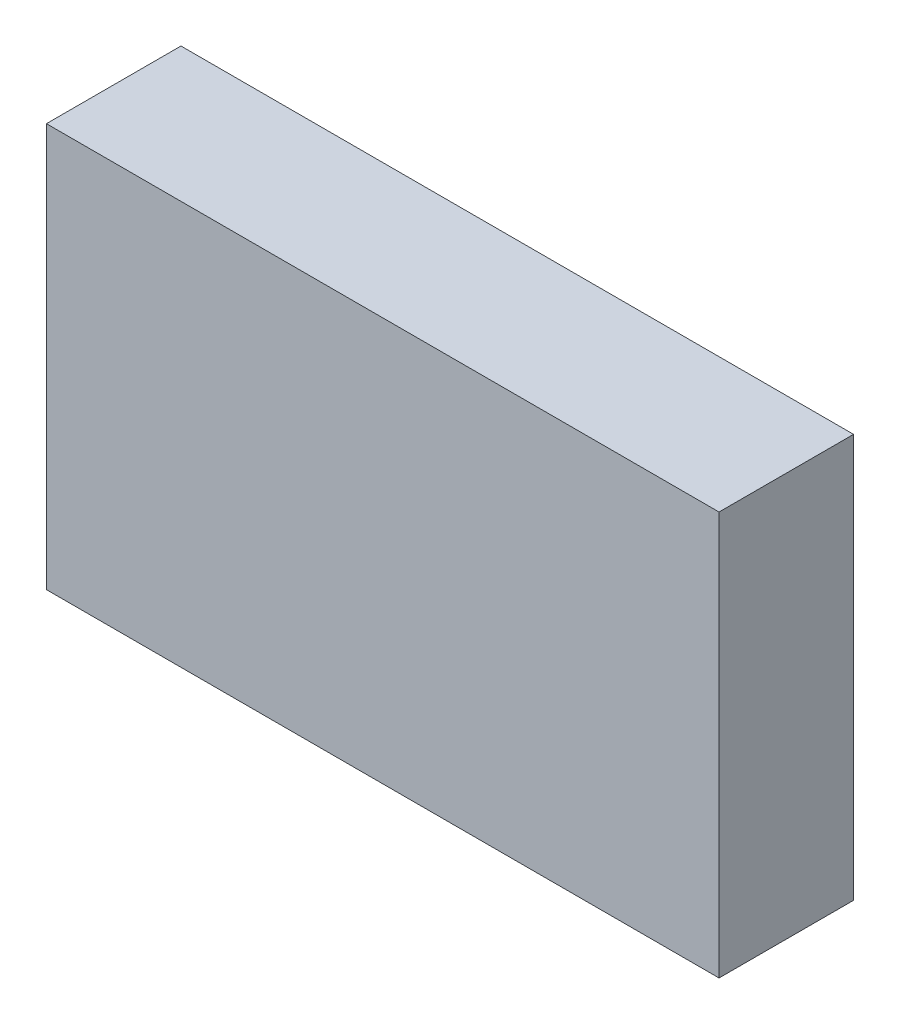
ISO-10303-21;
HEADER;
FILE_DESCRIPTION(('STEP AP214'),'2;1');
FILE_NAME('part.step','',(''),(''),'','','');
FILE_SCHEMA(('AUTOMOTIVE_DESIGN { 1 0 10303 214 1 1 1 1 }'));
ENDSEC;
DATA;
#1=APPLICATION_CONTEXT('core data for automotive mechanical design processes');
#2=APPLICATION_PROTOCOL_DEFINITION('international standard','automotive_design',2000,#1);
#3=PRODUCT_CONTEXT('',#1,'mechanical');
#4=PRODUCT('Part','Part','',(#3));
#5=PRODUCT_RELATED_PRODUCT_CATEGORY('part','',(#4));
#6=PRODUCT_DEFINITION_FORMATION('','',#4);
#7=PRODUCT_DEFINITION_CONTEXT('part definition',#1,'design');
#8=PRODUCT_DEFINITION('design','',#6,#7);
#9=PRODUCT_DEFINITION_SHAPE('','',#8);
#10=(LENGTH_UNIT() NAMED_UNIT(*) SI_UNIT(.MILLI.,.METRE.));
#11=(NAMED_UNIT(*) PLANE_ANGLE_UNIT() SI_UNIT($,.RADIAN.));
#12=(NAMED_UNIT(*) SI_UNIT($,.STERADIAN.) SOLID_ANGLE_UNIT());
#13=UNCERTAINTY_MEASURE_WITH_UNIT(LENGTH_MEASURE(1.E-05),#10,'distance_accuracy_value','');
#14=(GEOMETRIC_REPRESENTATION_CONTEXT(3) GLOBAL_UNCERTAINTY_ASSIGNED_CONTEXT((#13)) GLOBAL_UNIT_ASSIGNED_CONTEXT((#10,
#11,#12)) REPRESENTATION_CONTEXT('',''));
#15=CARTESIAN_POINT('',(0.,0.,0.));
#16=DIRECTION('',(0.,0.,1.));
#17=DIRECTION('',(1.,0.,0.));
#18=AXIS2_PLACEMENT_3D('',#15,#16,#17);
#19=CARTESIAN_POINT('',(-5.00000007450469,6.5689994413454,-2.12));
#20=DIRECTION('',(-1.,0.,0.));
#21=DIRECTION('',(0.,0.,1.));
#22=AXIS2_PLACEMENT_3D('',#19,#20,#21);
#23=PLANE('',#22);
#24=DIRECTION('',(0.,-1.,0.));
#25=VECTOR('',#24,1.);
#26=CARTESIAN_POINT('',(-5.00000007450469,9.5689994413454,-2.12));
#27=LINE('',#26,#25);
#28=CARTESIAN_POINT('',(-5.00000007450469,9.5689994413454,-2.12));
#29=VERTEX_POINT('',#28);
#30=CARTESIAN_POINT('',(-5.00000007450469,6.5689994413454,-2.12));
#31=VERTEX_POINT('',#30);
#32=EDGE_CURVE('E78',#29,#31,#27,.T.);
#33=ORIENTED_EDGE('',*,*,#32,.F.);
#34=DIRECTION('',(0.,0.,-1.));
#35=VECTOR('',#34,1.);
#36=CARTESIAN_POINT('',(-5.00000007450469,9.5689994413454,-2.12));
#37=LINE('',#36,#35);
#38=CARTESIAN_POINT('',(-5.00000007450469,9.5689994413454,-3.12));
#39=VERTEX_POINT('',#38);
#40=EDGE_CURVE('E66',#29,#39,#37,.T.);
#41=ORIENTED_EDGE('',*,*,#40,.T.);
#42=DIRECTION('',(0.,1.,0.));
#43=VECTOR('',#42,1.);
#44=CARTESIAN_POINT('',(-5.00000007450469,9.5689994413454,-3.12));
#45=LINE('',#44,#43);
#46=CARTESIAN_POINT('',(-5.00000007450469,6.5689994413454,-3.12));
#47=VERTEX_POINT('',#46);
#48=EDGE_CURVE('E97',#47,#39,#45,.T.);
#49=ORIENTED_EDGE('',*,*,#48,.F.);
#50=DIRECTION('',(0.,0.,-1.));
#51=VECTOR('',#50,1.);
#52=CARTESIAN_POINT('',(-5.00000007450469,6.5689994413454,-2.12));
#53=LINE('',#52,#51);
#54=EDGE_CURVE('E11',#31,#47,#53,.T.);
#55=ORIENTED_EDGE('',*,*,#54,.F.);
#56=EDGE_LOOP('',(#33,#41,#49,#55));
#57=FACE_BOUND('',#56,.T.);
#58=ADVANCED_FACE('F16',(#57),#23,.T.);
#59=CARTESIAN_POINT('',(-7.45046914787939E-08,6.5689994413454,-2.12));
#60=DIRECTION('',(0.,-1.,0.));
#61=DIRECTION('',(0.,0.,-1.));
#62=AXIS2_PLACEMENT_3D('',#59,#60,#61);
#63=PLANE('',#62);
#64=DIRECTION('',(1.,0.,0.));
#65=VECTOR('',#64,1.);
#66=CARTESIAN_POINT('',(-5.00000007450469,6.5689994413454,-2.12));
#67=LINE('',#66,#65);
#68=CARTESIAN_POINT('',(-7.45046914787939E-08,6.5689994413454,-2.12));
#69=VERTEX_POINT('',#68);
#70=EDGE_CURVE('E82',#31,#69,#67,.T.);
#71=ORIENTED_EDGE('',*,*,#70,.F.);
#72=ORIENTED_EDGE('',*,*,#54,.T.);
#73=DIRECTION('',(-1.,0.,0.));
#74=VECTOR('',#73,1.);
#75=CARTESIAN_POINT('',(-5.00000007450469,6.5689994413454,-3.12));
#76=LINE('',#75,#74);
#77=CARTESIAN_POINT('',(-7.45046914787939E-08,6.5689994413454,-3.12));
#78=VERTEX_POINT('',#77);
#79=EDGE_CURVE('E105',#78,#47,#76,.T.);
#80=ORIENTED_EDGE('',*,*,#79,.F.);
#81=DIRECTION('',(0.,0.,-1.));
#82=VECTOR('',#81,1.);
#83=CARTESIAN_POINT('',(-7.45046914787939E-08,6.5689994413454,-2.12));
#84=LINE('',#83,#82);
#85=EDGE_CURVE('E27',#69,#78,#84,.T.);
#86=ORIENTED_EDGE('',*,*,#85,.F.);
#87=EDGE_LOOP('',(#71,#72,#80,#86));
#88=FACE_BOUND('',#87,.T.);
#89=ADVANCED_FACE('F132',(#88),#63,.T.);
#90=CARTESIAN_POINT('',(-7.45046914787939E-08,9.5689994413454,-2.12));
#91=DIRECTION('',(1.,0.,0.));
#92=DIRECTION('',(0.,1.,0.));
#93=AXIS2_PLACEMENT_3D('',#90,#91,#92);
#94=PLANE('',#93);
#95=DIRECTION('',(0.,1.,0.));
#96=VECTOR('',#95,1.);
#97=CARTESIAN_POINT('',(-7.45046914787939E-08,6.5689994413454,-2.12));
#98=LINE('',#97,#96);
#99=CARTESIAN_POINT('',(-7.45046914787939E-08,9.5689994413454,-2.12));
#100=VERTEX_POINT('',#99);
#101=EDGE_CURVE('E87',#69,#100,#98,.T.);
#102=ORIENTED_EDGE('',*,*,#101,.F.);
#103=ORIENTED_EDGE('',*,*,#85,.T.);
#104=DIRECTION('',(0.,-1.,0.));
#105=VECTOR('',#104,1.);
#106=CARTESIAN_POINT('',(-7.45046914787939E-08,6.5689994413454,-3.12));
#107=LINE('',#106,#105);
#108=CARTESIAN_POINT('',(-7.45046914787939E-08,9.5689994413454,-3.12));
#109=VERTEX_POINT('',#108);
#110=EDGE_CURVE('E20',#109,#78,#107,.T.);
#111=ORIENTED_EDGE('',*,*,#110,.F.);
#112=DIRECTION('',(0.,0.,-1.));
#113=VECTOR('',#112,1.);
#114=CARTESIAN_POINT('',(-7.45046914787939E-08,9.5689994413454,-2.12));
#115=LINE('',#114,#113);
#116=EDGE_CURVE('E75',#100,#109,#115,.T.);
#117=ORIENTED_EDGE('',*,*,#116,.F.);
#118=EDGE_LOOP('',(#102,#103,#111,#117));
#119=FACE_BOUND('',#118,.T.);
#120=ADVANCED_FACE('F128',(#119),#94,.T.);
#121=CARTESIAN_POINT('',(-5.00000007450469,9.5689994413454,-2.12));
#122=DIRECTION('',(0.,1.,0.));
#123=DIRECTION('',(1.,0.,0.));
#124=AXIS2_PLACEMENT_3D('',#121,#122,#123);
#125=PLANE('',#124);
#126=DIRECTION('',(-1.,0.,0.));
#127=VECTOR('',#126,1.);
#128=CARTESIAN_POINT('',(-7.45046914787939E-08,9.5689994413454,-2.12));
#129=LINE('',#128,#127);
#130=EDGE_CURVE('E69',#100,#29,#129,.T.);
#131=ORIENTED_EDGE('',*,*,#130,.F.);
#132=ORIENTED_EDGE('',*,*,#116,.T.);
#133=DIRECTION('',(1.,0.,0.));
#134=VECTOR('',#133,1.);
#135=CARTESIAN_POINT('',(-7.45046914787939E-08,9.5689994413454,-3.12));
#136=LINE('',#135,#134);
#137=EDGE_CURVE('E71',#39,#109,#136,.T.);
#138=ORIENTED_EDGE('',*,*,#137,.F.);
#139=ORIENTED_EDGE('',*,*,#40,.F.);
#140=EDGE_LOOP('',(#131,#132,#138,#139));
#141=FACE_BOUND('',#140,.T.);
#142=ADVANCED_FACE('F18',(#141),#125,.T.);
#143=CARTESIAN_POINT('',(-2.50000007450469,8.0689994413454,-3.12));
#144=DIRECTION('',(0.,0.,-1.));
#145=DIRECTION('',(0.,-1.,0.));
#146=AXIS2_PLACEMENT_3D('',#143,#144,#145);
#147=PLANE('',#146);
#148=ORIENTED_EDGE('',*,*,#137,.T.);
#149=ORIENTED_EDGE('',*,*,#110,.T.);
#150=ORIENTED_EDGE('',*,*,#79,.T.);
#151=ORIENTED_EDGE('',*,*,#48,.T.);
#152=EDGE_LOOP('',(#148,#149,#150,#151));
#153=FACE_BOUND('',#152,.T.);
#154=ADVANCED_FACE('F119',(#153),#147,.T.);
#155=CARTESIAN_POINT('',(-2.50000007450469,8.0689994413454,-2.12));
#156=DIRECTION('',(0.,0.,-1.));
#157=DIRECTION('',(0.,-1.,0.));
#158=AXIS2_PLACEMENT_3D('',#155,#156,#157);
#159=PLANE('',#158);
#160=ORIENTED_EDGE('',*,*,#130,.T.);
#161=ORIENTED_EDGE('',*,*,#32,.T.);
#162=ORIENTED_EDGE('',*,*,#70,.T.);
#163=ORIENTED_EDGE('',*,*,#101,.T.);
#164=EDGE_LOOP('',(#160,#161,#162,#163));
#165=FACE_BOUND('',#164,.T.);
#166=ADVANCED_FACE('F85',(#165),#159,.F.);
#167=CLOSED_SHELL('',(#58,#89,#120,#142,#154,#166));
#168=MANIFOLD_SOLID_BREP('B1',#167);
#169=ADVANCED_BREP_SHAPE_REPRESENTATION('',(#18,#168),#14);
#170=SHAPE_DEFINITION_REPRESENTATION(#9,#169);
ENDSEC;
END-ISO-10303-21;
